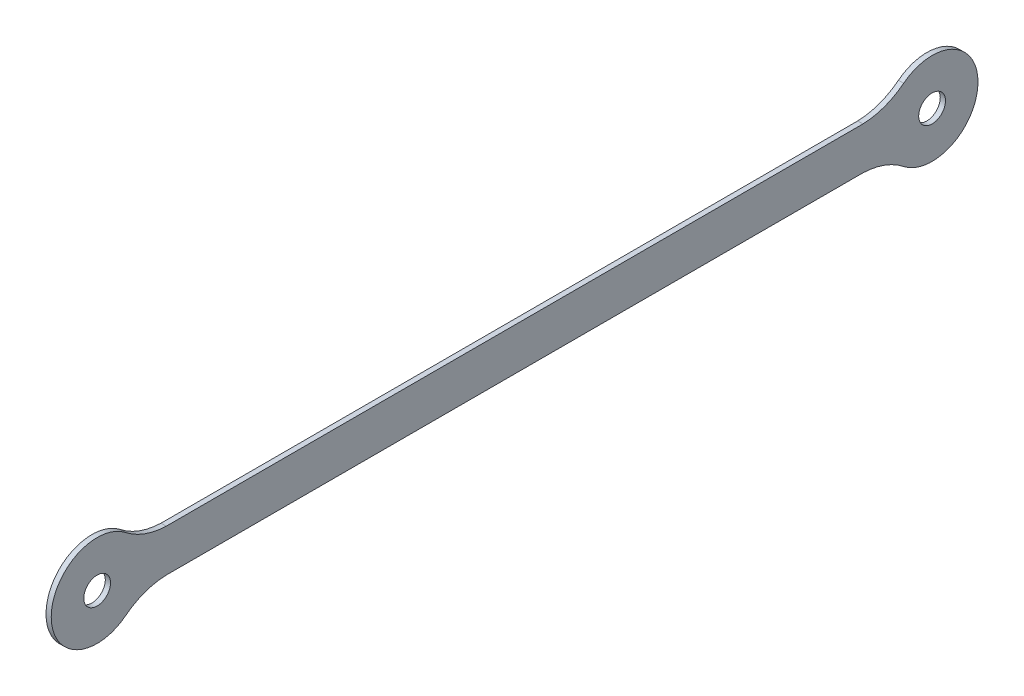
ISO-10303-21;
HEADER;
FILE_DESCRIPTION(('STEP AP214'),'2;1');
FILE_NAME('part.step','',(''),(''),'','','');
FILE_SCHEMA(('AUTOMOTIVE_DESIGN { 1 0 10303 214 1 1 1 1 }'));
ENDSEC;
DATA;
#1=APPLICATION_CONTEXT('core data for automotive mechanical design processes');
#2=APPLICATION_PROTOCOL_DEFINITION('international standard','automotive_design',2000,#1);
#3=PRODUCT_CONTEXT('',#1,'mechanical');
#4=PRODUCT('Part','Part','',(#3));
#5=PRODUCT_RELATED_PRODUCT_CATEGORY('part','',(#4));
#6=PRODUCT_DEFINITION_FORMATION('','',#4);
#7=PRODUCT_DEFINITION_CONTEXT('part definition',#1,'design');
#8=PRODUCT_DEFINITION('design','',#6,#7);
#9=PRODUCT_DEFINITION_SHAPE('','',#8);
#10=(LENGTH_UNIT() NAMED_UNIT(*) SI_UNIT(.MILLI.,.METRE.));
#11=(NAMED_UNIT(*) PLANE_ANGLE_UNIT() SI_UNIT($,.RADIAN.));
#12=(NAMED_UNIT(*) SI_UNIT($,.STERADIAN.) SOLID_ANGLE_UNIT());
#13=UNCERTAINTY_MEASURE_WITH_UNIT(LENGTH_MEASURE(1.E-05),#10,'distance_accuracy_value','');
#14=(GEOMETRIC_REPRESENTATION_CONTEXT(3) GLOBAL_UNCERTAINTY_ASSIGNED_CONTEXT((#13)) GLOBAL_UNIT_ASSIGNED_CONTEXT((#10,
#11,#12)) REPRESENTATION_CONTEXT('',''));
#15=CARTESIAN_POINT('',(0.,0.,0.));
#16=DIRECTION('',(0.,0.,1.));
#17=DIRECTION('',(1.,0.,0.));
#18=AXIS2_PLACEMENT_3D('',#15,#16,#17);
#19=CARTESIAN_POINT('',(1.5,25.9766205135187,85.5875404373089));
#20=DIRECTION('',(1.,0.,0.));
#21=DIRECTION('',(0.,0.,-1.));
#22=AXIS2_PLACEMENT_3D('',#19,#20,#21);
#23=PLANE('',#22);
#24=CARTESIAN_POINT('',(1.5,0.,-133.91124253769));
#25=DIRECTION('',(1.,0.,0.));
#26=DIRECTION('',(0.,0.,-1.));
#27=AXIS2_PLACEMENT_3D('',#24,#25,#26);
#28=CIRCLE('',#27,3.85);
#29=CARTESIAN_POINT('',(1.5,0.,-137.761242537689));
#30=VERTEX_POINT('',#29);
#31=EDGE_CURVE('E133',#30,#30,#28,.T.);
#32=ORIENTED_EDGE('',*,*,#31,.F.);
#33=EDGE_LOOP('',(#32));
#34=FACE_BOUND('',#33,.T.);
#35=CARTESIAN_POINT('',(1.5,25.9766205135187,85.5875404373089));
#36=DIRECTION('',(-1.,0.,0.));
#37=DIRECTION('',(0.,0.,-1.));
#38=AXIS2_PLACEMENT_3D('',#35,#36,#37);
#39=CIRCLE('',#38,19.896271768559);
#40=CARTESIAN_POINT('',(1.5,6.09028068506709,86.2161249707619));
#41=VERTEX_POINT('',#40);
#42=CARTESIAN_POINT('',(1.5,10.3584379096477,97.9136915981741));
#43=VERTEX_POINT('',#42);
#44=EDGE_CURVE('E144',#41,#43,#39,.T.);
#45=ORIENTED_EDGE('',*,*,#44,.T.);
#46=CARTESIAN_POINT('',(1.5,0.,106.08875746231));
#47=DIRECTION('',(1.,0.,0.));
#48=DIRECTION('',(0.,0.,-1.));
#49=AXIS2_PLACEMENT_3D('',#46,#47,#48);
#50=CIRCLE('',#49,13.1957924283081);
#51=CARTESIAN_POINT('',(1.5,-10.3584379096477,97.9136915981741));
#52=VERTEX_POINT('',#51);
#53=EDGE_CURVE('E92',#43,#52,#50,.T.);
#54=ORIENTED_EDGE('',*,*,#53,.T.);
#55=CARTESIAN_POINT('',(1.5,-25.9766205135187,85.5875404373089));
#56=DIRECTION('',(-1.,0.,0.));
#57=DIRECTION('',(0.,0.,1.));
#58=AXIS2_PLACEMENT_3D('',#55,#56,#57);
#59=CIRCLE('',#58,19.896271768559);
#60=CARTESIAN_POINT('',(1.5,-6.09028068506708,86.2161249707619));
#61=VERTEX_POINT('',#60);
#62=EDGE_CURVE('E159',#52,#61,#59,.T.);
#63=ORIENTED_EDGE('',*,*,#62,.T.);
#64=DIRECTION('',(0.,0.,-1.));
#65=VECTOR('',#64,1.);
#66=CARTESIAN_POINT('',(1.5,-6.09028068506709,-114.038610046141));
#67=LINE('',#66,#65);
#68=CARTESIAN_POINT('',(1.5,-6.09028068506709,-114.038610046141));
#69=VERTEX_POINT('',#68);
#70=EDGE_CURVE('E172',#61,#69,#67,.T.);
#71=ORIENTED_EDGE('',*,*,#70,.T.);
#72=CARTESIAN_POINT('',(1.5,-25.9766205135187,-113.410025512688));
#73=DIRECTION('',(-1.,0.,0.));
#74=DIRECTION('',(0.,0.,-1.));
#75=AXIS2_PLACEMENT_3D('',#72,#73,#74);
#76=CIRCLE('',#75,19.896271768559);
#77=CARTESIAN_POINT('',(1.5,-10.3584379096477,-125.736176673553));
#78=VERTEX_POINT('',#77);
#79=EDGE_CURVE('E111',#69,#78,#76,.T.);
#80=ORIENTED_EDGE('',*,*,#79,.T.);
#81=CARTESIAN_POINT('',(1.5,0.,-133.91124253769));
#82=DIRECTION('',(1.,0.,0.));
#83=DIRECTION('',(0.,0.,1.));
#84=AXIS2_PLACEMENT_3D('',#81,#82,#83);
#85=CIRCLE('',#84,13.1957924283081);
#86=CARTESIAN_POINT('',(1.5,10.3584379096477,-125.736176673553));
#87=VERTEX_POINT('',#86);
#88=EDGE_CURVE('E105',#78,#87,#85,.T.);
#89=ORIENTED_EDGE('',*,*,#88,.T.);
#90=CARTESIAN_POINT('',(1.5,25.9766205135187,-113.410025512688));
#91=DIRECTION('',(-1.,0.,0.));
#92=DIRECTION('',(0.,0.,1.));
#93=AXIS2_PLACEMENT_3D('',#90,#91,#92);
#94=CIRCLE('',#93,19.896271768559);
#95=CARTESIAN_POINT('',(1.5,6.0902806850671,-114.038610046141));
#96=VERTEX_POINT('',#95);
#97=EDGE_CURVE('E109',#87,#96,#94,.T.);
#98=ORIENTED_EDGE('',*,*,#97,.T.);
#99=DIRECTION('',(0.,0.,1.));
#100=VECTOR('',#99,1.);
#101=CARTESIAN_POINT('',(1.5,6.09028068506709,86.2161249707619));
#102=LINE('',#101,#100);
#103=EDGE_CURVE('E49',#96,#41,#102,.T.);
#104=ORIENTED_EDGE('',*,*,#103,.T.);
#105=EDGE_LOOP('',(#45,#54,#63,#71,#80,#89,#98,#104));
#106=FACE_BOUND('',#105,.T.);
#107=CARTESIAN_POINT('',(1.5,0.,106.08875746231));
#108=DIRECTION('',(1.,0.,0.));
#109=DIRECTION('',(0.,0.,-1.));
#110=AXIS2_PLACEMENT_3D('',#107,#108,#109);
#111=CIRCLE('',#110,3.85);
#112=CARTESIAN_POINT('',(1.5,0.,102.23875746231));
#113=VERTEX_POINT('',#112);
#114=EDGE_CURVE('E181',#113,#113,#111,.T.);
#115=ORIENTED_EDGE('',*,*,#114,.F.);
#116=EDGE_LOOP('',(#115));
#117=FACE_BOUND('',#116,.T.);
#118=ADVANCED_FACE('F32',(#34,#106,#117),#23,.T.);
#119=CARTESIAN_POINT('',(0.,25.9766205135187,85.5875404373089));
#120=DIRECTION('',(1.,0.,0.));
#121=DIRECTION('',(0.,0.,-1.));
#122=AXIS2_PLACEMENT_3D('',#119,#120,#121);
#123=PLANE('',#122);
#124=CARTESIAN_POINT('',(0.,25.9766205135187,85.5875404373089));
#125=DIRECTION('',(-1.,0.,0.));
#126=DIRECTION('',(0.,0.,-1.));
#127=AXIS2_PLACEMENT_3D('',#124,#125,#126);
#128=CIRCLE('',#127,19.896271768559);
#129=CARTESIAN_POINT('',(0.,6.09028068506709,86.2161249707619));
#130=VERTEX_POINT('',#129);
#131=CARTESIAN_POINT('',(0.,10.3584379096477,97.9136915981741));
#132=VERTEX_POINT('',#131);
#133=EDGE_CURVE('E129',#130,#132,#128,.T.);
#134=ORIENTED_EDGE('',*,*,#133,.F.);
#135=DIRECTION('',(0.,0.,1.));
#136=VECTOR('',#135,1.);
#137=CARTESIAN_POINT('',(0.,6.09028068506709,86.2161249707619));
#138=LINE('',#137,#136);
#139=CARTESIAN_POINT('',(0.,6.0902806850671,-114.038610046141));
#140=VERTEX_POINT('',#139);
#141=EDGE_CURVE('E84',#140,#130,#138,.T.);
#142=ORIENTED_EDGE('',*,*,#141,.F.);
#143=CARTESIAN_POINT('',(0.,25.9766205135187,-113.410025512688));
#144=DIRECTION('',(-1.,0.,0.));
#145=DIRECTION('',(0.,0.,1.));
#146=AXIS2_PLACEMENT_3D('',#143,#144,#145);
#147=CIRCLE('',#146,19.896271768559);
#148=CARTESIAN_POINT('',(0.,10.3584379096477,-125.736176673553));
#149=VERTEX_POINT('',#148);
#150=EDGE_CURVE('E78',#149,#140,#147,.T.);
#151=ORIENTED_EDGE('',*,*,#150,.F.);
#152=CARTESIAN_POINT('',(0.,0.,-133.91124253769));
#153=DIRECTION('',(1.,0.,0.));
#154=DIRECTION('',(0.,0.,1.));
#155=AXIS2_PLACEMENT_3D('',#152,#153,#154);
#156=CIRCLE('',#155,13.1957924283081);
#157=CARTESIAN_POINT('',(0.,-10.3584379096477,-125.736176673553));
#158=VERTEX_POINT('',#157);
#159=EDGE_CURVE('E119',#158,#149,#156,.T.);
#160=ORIENTED_EDGE('',*,*,#159,.F.);
#161=CARTESIAN_POINT('',(0.,-25.9766205135187,-113.410025512688));
#162=DIRECTION('',(-1.,0.,0.));
#163=DIRECTION('',(0.,0.,-1.));
#164=AXIS2_PLACEMENT_3D('',#161,#162,#163);
#165=CIRCLE('',#164,19.896271768559);
#166=CARTESIAN_POINT('',(0.,-6.09028068506709,-114.038610046141));
#167=VERTEX_POINT('',#166);
#168=EDGE_CURVE('E139',#167,#158,#165,.T.);
#169=ORIENTED_EDGE('',*,*,#168,.F.);
#170=DIRECTION('',(0.,0.,-1.));
#171=VECTOR('',#170,1.);
#172=CARTESIAN_POINT('',(0.,-6.09028068506709,-114.038610046141));
#173=LINE('',#172,#171);
#174=CARTESIAN_POINT('',(0.,-6.09028068506708,86.2161249707619));
#175=VERTEX_POINT('',#174);
#176=EDGE_CURVE('E137',#175,#167,#173,.T.);
#177=ORIENTED_EDGE('',*,*,#176,.F.);
#178=CARTESIAN_POINT('',(0.,-25.9766205135187,85.5875404373089));
#179=DIRECTION('',(-1.,0.,0.));
#180=DIRECTION('',(0.,0.,1.));
#181=AXIS2_PLACEMENT_3D('',#178,#179,#180);
#182=CIRCLE('',#181,19.896271768559);
#183=CARTESIAN_POINT('',(0.,-10.3584379096477,97.9136915981741));
#184=VERTEX_POINT('',#183);
#185=EDGE_CURVE('E135',#184,#175,#182,.T.);
#186=ORIENTED_EDGE('',*,*,#185,.F.);
#187=CARTESIAN_POINT('',(0.,0.,106.08875746231));
#188=DIRECTION('',(1.,0.,0.));
#189=DIRECTION('',(0.,0.,-1.));
#190=AXIS2_PLACEMENT_3D('',#187,#188,#189);
#191=CIRCLE('',#190,13.1957924283081);
#192=EDGE_CURVE('E132',#132,#184,#191,.T.);
#193=ORIENTED_EDGE('',*,*,#192,.F.);
#194=EDGE_LOOP('',(#134,#142,#151,#160,#169,#177,#186,#193));
#195=FACE_BOUND('',#194,.T.);
#196=CARTESIAN_POINT('',(0.,0.,-133.91124253769));
#197=DIRECTION('',(1.,0.,0.));
#198=DIRECTION('',(0.,0.,-1.));
#199=AXIS2_PLACEMENT_3D('',#196,#197,#198);
#200=CIRCLE('',#199,3.85);
#201=CARTESIAN_POINT('',(0.,0.,-137.761242537689));
#202=VERTEX_POINT('',#201);
#203=EDGE_CURVE('E178',#202,#202,#200,.T.);
#204=ORIENTED_EDGE('',*,*,#203,.T.);
#205=EDGE_LOOP('',(#204));
#206=FACE_BOUND('',#205,.T.);
#207=CARTESIAN_POINT('',(0.,0.,106.08875746231));
#208=DIRECTION('',(1.,0.,0.));
#209=DIRECTION('',(0.,0.,-1.));
#210=AXIS2_PLACEMENT_3D('',#207,#208,#209);
#211=CIRCLE('',#210,3.85);
#212=CARTESIAN_POINT('',(0.,0.,102.23875746231));
#213=VERTEX_POINT('',#212);
#214=EDGE_CURVE('E184',#213,#213,#211,.T.);
#215=ORIENTED_EDGE('',*,*,#214,.T.);
#216=EDGE_LOOP('',(#215));
#217=FACE_BOUND('',#216,.T.);
#218=ADVANCED_FACE('F163',(#195,#206,#217),#123,.F.);
#219=CARTESIAN_POINT('',(1.5,25.9766205135187,85.5875404373089));
#220=DIRECTION('',(-1.,0.,0.));
#221=DIRECTION('',(0.,0.,1.));
#222=AXIS2_PLACEMENT_3D('',#219,#220,#221);
#223=CYLINDRICAL_SURFACE('',#222,19.896271768559);
#224=ORIENTED_EDGE('',*,*,#133,.T.);
#225=DIRECTION('',(-1.,0.,0.));
#226=VECTOR('',#225,1.);
#227=CARTESIAN_POINT('',(1.5,10.3584379096477,97.9136915981741));
#228=LINE('',#227,#226);
#229=EDGE_CURVE('E11',#43,#132,#228,.T.);
#230=ORIENTED_EDGE('',*,*,#229,.F.);
#231=ORIENTED_EDGE('',*,*,#44,.F.);
#232=DIRECTION('',(-1.,0.,0.));
#233=VECTOR('',#232,1.);
#234=CARTESIAN_POINT('',(1.5,6.09028068506709,86.2161249707619));
#235=LINE('',#234,#233);
#236=EDGE_CURVE('E125',#41,#130,#235,.T.);
#237=ORIENTED_EDGE('',*,*,#236,.T.);
#238=EDGE_LOOP('',(#224,#230,#231,#237));
#239=FACE_BOUND('',#238,.T.);
#240=ADVANCED_FACE('F34',(#239),#223,.F.);
#241=CARTESIAN_POINT('',(1.5,0.,106.08875746231));
#242=DIRECTION('',(-1.,0.,0.));
#243=DIRECTION('',(0.,0.,1.));
#244=AXIS2_PLACEMENT_3D('',#241,#242,#243);
#245=CYLINDRICAL_SURFACE('',#244,13.1957924283081);
#246=ORIENTED_EDGE('',*,*,#192,.T.);
#247=DIRECTION('',(-1.,0.,0.));
#248=VECTOR('',#247,1.);
#249=CARTESIAN_POINT('',(1.5,-10.3584379096477,97.9136915981741));
#250=LINE('',#249,#248);
#251=EDGE_CURVE('E41',#52,#184,#250,.T.);
#252=ORIENTED_EDGE('',*,*,#251,.F.);
#253=ORIENTED_EDGE('',*,*,#53,.F.);
#254=ORIENTED_EDGE('',*,*,#229,.T.);
#255=EDGE_LOOP('',(#246,#252,#253,#254));
#256=FACE_BOUND('',#255,.T.);
#257=ADVANCED_FACE('F216',(#256),#245,.T.);
#258=CARTESIAN_POINT('',(1.5,-25.9766205135187,85.5875404373089));
#259=DIRECTION('',(-1.,0.,0.));
#260=DIRECTION('',(0.,0.,1.));
#261=AXIS2_PLACEMENT_3D('',#258,#259,#260);
#262=CYLINDRICAL_SURFACE('',#261,19.896271768559);
#263=ORIENTED_EDGE('',*,*,#185,.T.);
#264=DIRECTION('',(-1.,0.,0.));
#265=VECTOR('',#264,1.);
#266=CARTESIAN_POINT('',(1.5,-6.09028068506708,86.2161249707619));
#267=LINE('',#266,#265);
#268=EDGE_CURVE('E151',#61,#175,#267,.T.);
#269=ORIENTED_EDGE('',*,*,#268,.F.);
#270=ORIENTED_EDGE('',*,*,#62,.F.);
#271=ORIENTED_EDGE('',*,*,#251,.T.);
#272=EDGE_LOOP('',(#263,#269,#270,#271));
#273=FACE_BOUND('',#272,.T.);
#274=ADVANCED_FACE('F157',(#273),#262,.F.);
#275=CARTESIAN_POINT('',(1.5,-6.09028068506709,-114.038610046141));
#276=DIRECTION('',(0.,1.,0.));
#277=DIRECTION('',(0.,0.,1.));
#278=AXIS2_PLACEMENT_3D('',#275,#276,#277);
#279=PLANE('',#278);
#280=ORIENTED_EDGE('',*,*,#176,.T.);
#281=DIRECTION('',(-1.,0.,0.));
#282=VECTOR('',#281,1.);
#283=CARTESIAN_POINT('',(1.5,-6.09028068506709,-114.038610046141));
#284=LINE('',#283,#282);
#285=EDGE_CURVE('E148',#69,#167,#284,.T.);
#286=ORIENTED_EDGE('',*,*,#285,.F.);
#287=ORIENTED_EDGE('',*,*,#70,.F.);
#288=ORIENTED_EDGE('',*,*,#268,.T.);
#289=EDGE_LOOP('',(#280,#286,#287,#288));
#290=FACE_BOUND('',#289,.T.);
#291=ADVANCED_FACE('F168',(#290),#279,.F.);
#292=CARTESIAN_POINT('',(1.5,-25.9766205135187,-113.410025512688));
#293=DIRECTION('',(-1.,0.,0.));
#294=DIRECTION('',(0.,0.,1.));
#295=AXIS2_PLACEMENT_3D('',#292,#293,#294);
#296=CYLINDRICAL_SURFACE('',#295,19.896271768559);
#297=ORIENTED_EDGE('',*,*,#168,.T.);
#298=DIRECTION('',(-1.,0.,0.));
#299=VECTOR('',#298,1.);
#300=CARTESIAN_POINT('',(1.5,-10.3584379096477,-125.736176673553));
#301=LINE('',#300,#299);
#302=EDGE_CURVE('E120',#78,#158,#301,.T.);
#303=ORIENTED_EDGE('',*,*,#302,.F.);
#304=ORIENTED_EDGE('',*,*,#79,.F.);
#305=ORIENTED_EDGE('',*,*,#285,.T.);
#306=EDGE_LOOP('',(#297,#303,#304,#305));
#307=FACE_BOUND('',#306,.T.);
#308=ADVANCED_FACE('F171',(#307),#296,.F.);
#309=CARTESIAN_POINT('',(1.5,0.,-133.91124253769));
#310=DIRECTION('',(-1.,0.,0.));
#311=DIRECTION('',(0.,0.,1.));
#312=AXIS2_PLACEMENT_3D('',#309,#310,#311);
#313=CYLINDRICAL_SURFACE('',#312,13.1957924283081);
#314=ORIENTED_EDGE('',*,*,#159,.T.);
#315=DIRECTION('',(-1.,0.,0.));
#316=VECTOR('',#315,1.);
#317=CARTESIAN_POINT('',(1.5,10.3584379096477,-125.736176673553));
#318=LINE('',#317,#316);
#319=EDGE_CURVE('E116',#87,#149,#318,.T.);
#320=ORIENTED_EDGE('',*,*,#319,.F.);
#321=ORIENTED_EDGE('',*,*,#88,.F.);
#322=ORIENTED_EDGE('',*,*,#302,.T.);
#323=EDGE_LOOP('',(#314,#320,#321,#322));
#324=FACE_BOUND('',#323,.T.);
#325=ADVANCED_FACE('F117',(#324),#313,.T.);
#326=CARTESIAN_POINT('',(1.5,25.9766205135187,-113.410025512688));
#327=DIRECTION('',(-1.,0.,0.));
#328=DIRECTION('',(0.,0.,1.));
#329=AXIS2_PLACEMENT_3D('',#326,#327,#328);
#330=CYLINDRICAL_SURFACE('',#329,19.896271768559);
#331=ORIENTED_EDGE('',*,*,#150,.T.);
#332=DIRECTION('',(-1.,0.,0.));
#333=VECTOR('',#332,1.);
#334=CARTESIAN_POINT('',(1.5,6.0902806850671,-114.038610046141));
#335=LINE('',#334,#333);
#336=EDGE_CURVE('E121',#96,#140,#335,.T.);
#337=ORIENTED_EDGE('',*,*,#336,.F.);
#338=ORIENTED_EDGE('',*,*,#97,.F.);
#339=ORIENTED_EDGE('',*,*,#319,.T.);
#340=EDGE_LOOP('',(#331,#337,#338,#339));
#341=FACE_BOUND('',#340,.T.);
#342=ADVANCED_FACE('F123',(#341),#330,.F.);
#343=CARTESIAN_POINT('',(1.5,6.09028068506709,86.2161249707619));
#344=DIRECTION('',(0.,-1.,0.));
#345=DIRECTION('',(0.,0.,-1.));
#346=AXIS2_PLACEMENT_3D('',#343,#344,#345);
#347=PLANE('',#346);
#348=ORIENTED_EDGE('',*,*,#141,.T.);
#349=ORIENTED_EDGE('',*,*,#236,.F.);
#350=ORIENTED_EDGE('',*,*,#103,.F.);
#351=ORIENTED_EDGE('',*,*,#336,.T.);
#352=EDGE_LOOP('',(#348,#349,#350,#351));
#353=FACE_BOUND('',#352,.T.);
#354=ADVANCED_FACE('F204',(#353),#347,.F.);
#355=CARTESIAN_POINT('',(1.5,0.,-133.91124253769));
#356=DIRECTION('',(-1.,0.,0.));
#357=DIRECTION('',(0.,0.,1.));
#358=AXIS2_PLACEMENT_3D('',#355,#356,#357);
#359=CYLINDRICAL_SURFACE('',#358,3.85);
#360=ORIENTED_EDGE('',*,*,#31,.T.);
#361=EDGE_LOOP('',(#360));
#362=FACE_BOUND('',#361,.T.);
#363=ORIENTED_EDGE('',*,*,#203,.F.);
#364=EDGE_LOOP('',(#363));
#365=FACE_BOUND('',#364,.T.);
#366=ADVANCED_FACE('F201',(#362,#365),#359,.F.);
#367=CARTESIAN_POINT('',(1.5,0.,106.08875746231));
#368=DIRECTION('',(-1.,0.,0.));
#369=DIRECTION('',(0.,0.,1.));
#370=AXIS2_PLACEMENT_3D('',#367,#368,#369);
#371=CYLINDRICAL_SURFACE('',#370,3.85);
#372=ORIENTED_EDGE('',*,*,#114,.T.);
#373=EDGE_LOOP('',(#372));
#374=FACE_BOUND('',#373,.T.);
#375=ORIENTED_EDGE('',*,*,#214,.F.);
#376=EDGE_LOOP('',(#375));
#377=FACE_BOUND('',#376,.T.);
#378=ADVANCED_FACE('F190',(#374,#377),#371,.F.);
#379=CLOSED_SHELL('',(#118,#218,#240,#257,#274,#291,#308,#325,#342,#354,#366,#378));
#380=MANIFOLD_SOLID_BREP('B2',#379);
#381=ADVANCED_BREP_SHAPE_REPRESENTATION('',(#18,#380),#14);
#382=SHAPE_DEFINITION_REPRESENTATION(#9,#381);
ENDSEC;
END-ISO-10303-21;
